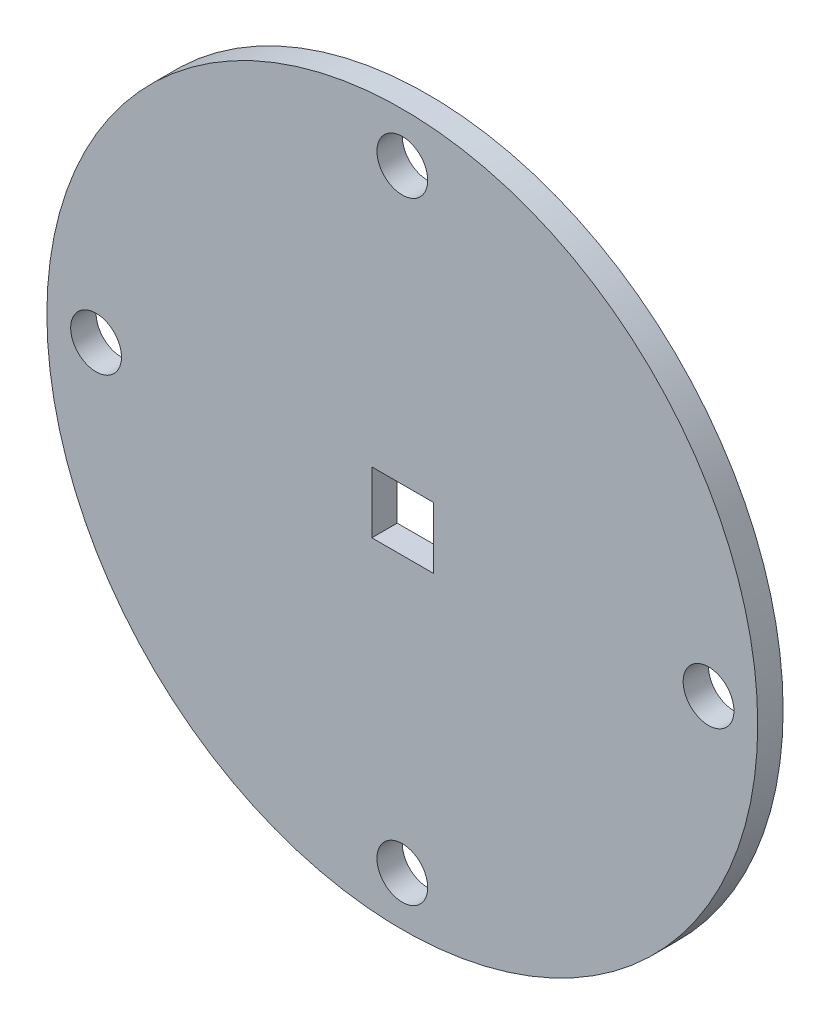
ISO-10303-21;
HEADER;
FILE_DESCRIPTION(('STEP AP214'),'2;1');
FILE_NAME('part.step','',(''),(''),'','','');
FILE_SCHEMA(('AUTOMOTIVE_DESIGN { 1 0 10303 214 1 1 1 1 }'));
ENDSEC;
DATA;
#1=APPLICATION_CONTEXT('core data for automotive mechanical design processes');
#2=APPLICATION_PROTOCOL_DEFINITION('international standard','automotive_design',2000,#1);
#3=PRODUCT_CONTEXT('',#1,'mechanical');
#4=PRODUCT('Part','Part','',(#3));
#5=PRODUCT_RELATED_PRODUCT_CATEGORY('part','',(#4));
#6=PRODUCT_DEFINITION_FORMATION('','',#4);
#7=PRODUCT_DEFINITION_CONTEXT('part definition',#1,'design');
#8=PRODUCT_DEFINITION('design','',#6,#7);
#9=PRODUCT_DEFINITION_SHAPE('','',#8);
#10=(LENGTH_UNIT() NAMED_UNIT(*) SI_UNIT(.MILLI.,.METRE.));
#11=(NAMED_UNIT(*) PLANE_ANGLE_UNIT() SI_UNIT($,.RADIAN.));
#12=(NAMED_UNIT(*) SI_UNIT($,.STERADIAN.) SOLID_ANGLE_UNIT());
#13=UNCERTAINTY_MEASURE_WITH_UNIT(LENGTH_MEASURE(1.E-05),#10,'distance_accuracy_value','');
#14=(GEOMETRIC_REPRESENTATION_CONTEXT(3) GLOBAL_UNCERTAINTY_ASSIGNED_CONTEXT((#13)) GLOBAL_UNIT_ASSIGNED_CONTEXT((#10,
#11,#12)) REPRESENTATION_CONTEXT('',''));
#15=CARTESIAN_POINT('',(0.,0.,0.));
#16=DIRECTION('',(0.,0.,1.));
#17=DIRECTION('',(1.,0.,0.));
#18=AXIS2_PLACEMENT_3D('',#15,#16,#17);
#19=CARTESIAN_POINT('',(0.,0.,5.));
#20=DIRECTION('',(0.,0.,1.));
#21=DIRECTION('',(1.,0.,0.));
#22=AXIS2_PLACEMENT_3D('',#19,#20,#21);
#23=PLANE('',#22);
#24=CARTESIAN_POINT('',(3.41345490180402E-12,-60.31,5.));
#25=DIRECTION('',(0.,0.,1.));
#26=DIRECTION('',(1.,0.,0.));
#27=AXIS2_PLACEMENT_3D('',#24,#25,#26);
#28=CIRCLE('',#27,5.00000000000367);
#29=CARTESIAN_POINT('',(5.00000000000708,-60.31,5.));
#30=VERTEX_POINT('',#29);
#31=EDGE_CURVE('E208',#30,#30,#28,.T.);
#32=ORIENTED_EDGE('',*,*,#31,.F.);
#33=EDGE_LOOP('',(#32));
#34=FACE_BOUND('',#33,.T.);
#35=CARTESIAN_POINT('',(0.,60.31,5.));
#36=DIRECTION('',(0.,0.,1.));
#37=DIRECTION('',(1.,0.,0.));
#38=AXIS2_PLACEMENT_3D('',#35,#36,#37);
#39=CIRCLE('',#38,5.);
#40=CARTESIAN_POINT('',(5.,60.31,5.));
#41=VERTEX_POINT('',#40);
#42=EDGE_CURVE('E104',#41,#41,#39,.T.);
#43=ORIENTED_EDGE('',*,*,#42,.F.);
#44=EDGE_LOOP('',(#43));
#45=FACE_BOUND('',#44,.T.);
#46=CARTESIAN_POINT('',(0.,0.,5.));
#47=DIRECTION('',(0.,0.,1.));
#48=DIRECTION('',(1.,0.,0.));
#49=AXIS2_PLACEMENT_3D('',#46,#47,#48);
#50=CIRCLE('',#49,70.);
#51=CARTESIAN_POINT('',(70.,0.,5.));
#52=VERTEX_POINT('',#51);
#53=EDGE_CURVE('E11',#52,#52,#50,.T.);
#54=ORIENTED_EDGE('',*,*,#53,.T.);
#55=EDGE_LOOP('',(#54));
#56=FACE_BOUND('',#55,.T.);
#57=DIRECTION('',(-1.,0.,0.));
#58=VECTOR('',#57,1.);
#59=CARTESIAN_POINT('',(-6.,5.95,5.));
#60=LINE('',#59,#58);
#61=CARTESIAN_POINT('',(6.1,5.95,5.));
#62=VERTEX_POINT('',#61);
#63=CARTESIAN_POINT('',(-6.,5.95,5.));
#64=VERTEX_POINT('',#63);
#65=EDGE_CURVE('E84',#62,#64,#60,.T.);
#66=ORIENTED_EDGE('',*,*,#65,.F.);
#67=DIRECTION('',(0.,1.,0.));
#68=VECTOR('',#67,1.);
#69=CARTESIAN_POINT('',(6.1,-6.15,5.));
#70=LINE('',#69,#68);
#71=CARTESIAN_POINT('',(6.1,-6.15,5.));
#72=VERTEX_POINT('',#71);
#73=EDGE_CURVE('E76',#72,#62,#70,.T.);
#74=ORIENTED_EDGE('',*,*,#73,.F.);
#75=DIRECTION('',(1.,0.,0.));
#76=VECTOR('',#75,1.);
#77=CARTESIAN_POINT('',(-6.,-6.15,5.));
#78=LINE('',#77,#76);
#79=CARTESIAN_POINT('',(-6.,-6.15,5.));
#80=VERTEX_POINT('',#79);
#81=EDGE_CURVE('E98',#80,#72,#78,.T.);
#82=ORIENTED_EDGE('',*,*,#81,.F.);
#83=DIRECTION('',(0.,-1.,0.));
#84=VECTOR('',#83,1.);
#85=CARTESIAN_POINT('',(-6.,-6.15,5.));
#86=LINE('',#85,#84);
#87=EDGE_CURVE('E96',#64,#80,#86,.T.);
#88=ORIENTED_EDGE('',*,*,#87,.F.);
#89=EDGE_LOOP('',(#66,#74,#82,#88));
#90=FACE_BOUND('',#89,.T.);
#91=CARTESIAN_POINT('',(60.3100000000017,1.70672745090201E-12,5.));
#92=DIRECTION('',(0.,0.,1.));
#93=DIRECTION('',(1.,0.,0.));
#94=AXIS2_PLACEMENT_3D('',#91,#92,#93);
#95=CIRCLE('',#94,5.00000000000134);
#96=CARTESIAN_POINT('',(65.3100000000031,1.70672745090201E-12,5.));
#97=VERTEX_POINT('',#96);
#98=EDGE_CURVE('E214',#97,#97,#95,.T.);
#99=ORIENTED_EDGE('',*,*,#98,.F.);
#100=EDGE_LOOP('',(#99));
#101=FACE_BOUND('',#100,.T.);
#102=CARTESIAN_POINT('',(-60.3099999999983,-1.71411329574767E-12,5.));
#103=DIRECTION('',(0.,0.,1.));
#104=DIRECTION('',(1.,0.,0.));
#105=AXIS2_PLACEMENT_3D('',#102,#103,#104);
#106=CIRCLE('',#105,5.00000000000274);
#107=CARTESIAN_POINT('',(-55.3099999999956,-1.71411329574767E-12,5.));
#108=VERTEX_POINT('',#107);
#109=EDGE_CURVE('E199',#108,#108,#106,.T.);
#110=ORIENTED_EDGE('',*,*,#109,.F.);
#111=EDGE_LOOP('',(#110));
#112=FACE_BOUND('',#111,.T.);
#113=ADVANCED_FACE('F35',(#34,#45,#56,#90,#101,#112),#23,.T.);
#114=CARTESIAN_POINT('',(0.,0.,0.));
#115=DIRECTION('',(0.,0.,1.));
#116=DIRECTION('',(1.,0.,0.));
#117=AXIS2_PLACEMENT_3D('',#114,#115,#116);
#118=PLANE('',#117);
#119=CARTESIAN_POINT('',(0.,0.,0.));
#120=DIRECTION('',(0.,0.,1.));
#121=DIRECTION('',(1.,0.,0.));
#122=AXIS2_PLACEMENT_3D('',#119,#120,#121);
#123=CIRCLE('',#122,70.);
#124=CARTESIAN_POINT('',(70.,0.,0.));
#125=VERTEX_POINT('',#124);
#126=EDGE_CURVE('E39',#125,#125,#123,.T.);
#127=ORIENTED_EDGE('',*,*,#126,.F.);
#128=EDGE_LOOP('',(#127));
#129=FACE_BOUND('',#128,.T.);
#130=DIRECTION('',(0.,1.,0.));
#131=VECTOR('',#130,1.);
#132=CARTESIAN_POINT('',(6.1,-6.15,0.));
#133=LINE('',#132,#131);
#134=CARTESIAN_POINT('',(6.1,-6.15,0.));
#135=VERTEX_POINT('',#134);
#136=CARTESIAN_POINT('',(6.1,5.95,0.));
#137=VERTEX_POINT('',#136);
#138=EDGE_CURVE('E58',#135,#137,#133,.T.);
#139=ORIENTED_EDGE('',*,*,#138,.T.);
#140=DIRECTION('',(-1.,0.,0.));
#141=VECTOR('',#140,1.);
#142=CARTESIAN_POINT('',(-6.,5.95,0.));
#143=LINE('',#142,#141);
#144=CARTESIAN_POINT('',(-6.,5.95,0.));
#145=VERTEX_POINT('',#144);
#146=EDGE_CURVE('E91',#137,#145,#143,.T.);
#147=ORIENTED_EDGE('',*,*,#146,.T.);
#148=DIRECTION('',(0.,-1.,0.));
#149=VECTOR('',#148,1.);
#150=CARTESIAN_POINT('',(-6.,-6.15,0.));
#151=LINE('',#150,#149);
#152=CARTESIAN_POINT('',(-6.,-6.15,0.));
#153=VERTEX_POINT('',#152);
#154=EDGE_CURVE('E106',#145,#153,#151,.T.);
#155=ORIENTED_EDGE('',*,*,#154,.T.);
#156=DIRECTION('',(1.,0.,0.));
#157=VECTOR('',#156,1.);
#158=CARTESIAN_POINT('',(-6.,-6.15,0.));
#159=LINE('',#158,#157);
#160=EDGE_CURVE('E85',#153,#135,#159,.T.);
#161=ORIENTED_EDGE('',*,*,#160,.T.);
#162=EDGE_LOOP('',(#139,#147,#155,#161));
#163=FACE_BOUND('',#162,.T.);
#164=CARTESIAN_POINT('',(0.,60.31,0.));
#165=DIRECTION('',(0.,0.,1.));
#166=DIRECTION('',(1.,0.,0.));
#167=AXIS2_PLACEMENT_3D('',#164,#165,#166);
#168=CIRCLE('',#167,5.);
#169=CARTESIAN_POINT('',(5.,60.31,0.));
#170=VERTEX_POINT('',#169);
#171=EDGE_CURVE('E217',#170,#170,#168,.T.);
#172=ORIENTED_EDGE('',*,*,#171,.T.);
#173=EDGE_LOOP('',(#172));
#174=FACE_BOUND('',#173,.T.);
#175=CARTESIAN_POINT('',(60.3100000000017,1.70672745090201E-12,0.));
#176=DIRECTION('',(0.,0.,1.));
#177=DIRECTION('',(1.,0.,0.));
#178=AXIS2_PLACEMENT_3D('',#175,#176,#177);
#179=CIRCLE('',#178,5.00000000000134);
#180=CARTESIAN_POINT('',(65.3100000000031,1.70672745090201E-12,0.));
#181=VERTEX_POINT('',#180);
#182=EDGE_CURVE('E211',#181,#181,#179,.T.);
#183=ORIENTED_EDGE('',*,*,#182,.T.);
#184=EDGE_LOOP('',(#183));
#185=FACE_BOUND('',#184,.T.);
#186=CARTESIAN_POINT('',(3.41345490180402E-12,-60.31,0.));
#187=DIRECTION('',(0.,0.,1.));
#188=DIRECTION('',(1.,0.,0.));
#189=AXIS2_PLACEMENT_3D('',#186,#187,#188);
#190=CIRCLE('',#189,5.00000000000367);
#191=CARTESIAN_POINT('',(5.00000000000708,-60.31,0.));
#192=VERTEX_POINT('',#191);
#193=EDGE_CURVE('E205',#192,#192,#190,.T.);
#194=ORIENTED_EDGE('',*,*,#193,.T.);
#195=EDGE_LOOP('',(#194));
#196=FACE_BOUND('',#195,.T.);
#197=CARTESIAN_POINT('',(-60.3099999999983,-1.71411329574767E-12,0.));
#198=DIRECTION('',(0.,0.,1.));
#199=DIRECTION('',(1.,0.,0.));
#200=AXIS2_PLACEMENT_3D('',#197,#198,#199);
#201=CIRCLE('',#200,5.00000000000274);
#202=CARTESIAN_POINT('',(-55.3099999999956,-1.71411329574767E-12,0.));
#203=VERTEX_POINT('',#202);
#204=EDGE_CURVE('E202',#203,#203,#201,.T.);
#205=ORIENTED_EDGE('',*,*,#204,.T.);
#206=EDGE_LOOP('',(#205));
#207=FACE_BOUND('',#206,.T.);
#208=ADVANCED_FACE('F117',(#129,#163,#174,#185,#196,#207),#118,.F.);
#209=CARTESIAN_POINT('',(0.,0.,5.));
#210=DIRECTION('',(0.,0.,-1.));
#211=DIRECTION('',(-1.,0.,0.));
#212=AXIS2_PLACEMENT_3D('',#209,#210,#211);
#213=CYLINDRICAL_SURFACE('',#212,70.);
#214=ORIENTED_EDGE('',*,*,#53,.F.);
#215=EDGE_LOOP('',(#214));
#216=FACE_BOUND('',#215,.T.);
#217=ORIENTED_EDGE('',*,*,#126,.T.);
#218=EDGE_LOOP('',(#217));
#219=FACE_BOUND('',#218,.T.);
#220=ADVANCED_FACE('F37',(#216,#219),#213,.T.);
#221=CARTESIAN_POINT('',(6.1,-6.15,5.));
#222=DIRECTION('',(-1.,0.,0.));
#223=DIRECTION('',(0.,0.,1.));
#224=AXIS2_PLACEMENT_3D('',#221,#222,#223);
#225=PLANE('',#224);
#226=ORIENTED_EDGE('',*,*,#138,.F.);
#227=DIRECTION('',(0.,0.,-1.));
#228=VECTOR('',#227,1.);
#229=CARTESIAN_POINT('',(6.1,-6.15,5.));
#230=LINE('',#229,#228);
#231=EDGE_CURVE('E80',#72,#135,#230,.T.);
#232=ORIENTED_EDGE('',*,*,#231,.F.);
#233=ORIENTED_EDGE('',*,*,#73,.T.);
#234=DIRECTION('',(0.,0.,-1.));
#235=VECTOR('',#234,1.);
#236=CARTESIAN_POINT('',(6.1,5.95,5.));
#237=LINE('',#236,#235);
#238=EDGE_CURVE('E79',#62,#137,#237,.T.);
#239=ORIENTED_EDGE('',*,*,#238,.T.);
#240=EDGE_LOOP('',(#226,#232,#233,#239));
#241=FACE_BOUND('',#240,.T.);
#242=ADVANCED_FACE('F78',(#241),#225,.T.);
#243=CARTESIAN_POINT('',(-6.,5.95,5.));
#244=DIRECTION('',(0.,-1.,0.));
#245=DIRECTION('',(0.,0.,-1.));
#246=AXIS2_PLACEMENT_3D('',#243,#244,#245);
#247=PLANE('',#246);
#248=ORIENTED_EDGE('',*,*,#146,.F.);
#249=ORIENTED_EDGE('',*,*,#238,.F.);
#250=ORIENTED_EDGE('',*,*,#65,.T.);
#251=DIRECTION('',(0.,0.,-1.));
#252=VECTOR('',#251,1.);
#253=CARTESIAN_POINT('',(-6.,5.95,5.));
#254=LINE('',#253,#252);
#255=EDGE_CURVE('E92',#64,#145,#254,.T.);
#256=ORIENTED_EDGE('',*,*,#255,.T.);
#257=EDGE_LOOP('',(#248,#249,#250,#256));
#258=FACE_BOUND('',#257,.T.);
#259=ADVANCED_FACE('F88',(#258),#247,.T.);
#260=CARTESIAN_POINT('',(-6.,-6.15,5.));
#261=DIRECTION('',(1.,0.,0.));
#262=DIRECTION('',(0.,0.,-1.));
#263=AXIS2_PLACEMENT_3D('',#260,#261,#262);
#264=PLANE('',#263);
#265=ORIENTED_EDGE('',*,*,#154,.F.);
#266=ORIENTED_EDGE('',*,*,#255,.F.);
#267=ORIENTED_EDGE('',*,*,#87,.T.);
#268=DIRECTION('',(0.,0.,-1.));
#269=VECTOR('',#268,1.);
#270=CARTESIAN_POINT('',(-6.,-6.15,5.));
#271=LINE('',#270,#269);
#272=EDGE_CURVE('E50',#80,#153,#271,.T.);
#273=ORIENTED_EDGE('',*,*,#272,.T.);
#274=EDGE_LOOP('',(#265,#266,#267,#273));
#275=FACE_BOUND('',#274,.T.);
#276=ADVANCED_FACE('F115',(#275),#264,.T.);
#277=CARTESIAN_POINT('',(-6.,-6.15,5.));
#278=DIRECTION('',(0.,1.,0.));
#279=DIRECTION('',(0.,0.,1.));
#280=AXIS2_PLACEMENT_3D('',#277,#278,#279);
#281=PLANE('',#280);
#282=ORIENTED_EDGE('',*,*,#160,.F.);
#283=ORIENTED_EDGE('',*,*,#272,.F.);
#284=ORIENTED_EDGE('',*,*,#81,.T.);
#285=ORIENTED_EDGE('',*,*,#231,.T.);
#286=EDGE_LOOP('',(#282,#283,#284,#285));
#287=FACE_BOUND('',#286,.T.);
#288=ADVANCED_FACE('F119',(#287),#281,.T.);
#289=CARTESIAN_POINT('',(0.,60.31,5.));
#290=DIRECTION('',(0.,0.,-1.));
#291=DIRECTION('',(-1.,0.,0.));
#292=AXIS2_PLACEMENT_3D('',#289,#290,#291);
#293=CYLINDRICAL_SURFACE('',#292,5.);
#294=ORIENTED_EDGE('',*,*,#42,.T.);
#295=EDGE_LOOP('',(#294));
#296=FACE_BOUND('',#295,.T.);
#297=ORIENTED_EDGE('',*,*,#171,.F.);
#298=EDGE_LOOP('',(#297));
#299=FACE_BOUND('',#298,.T.);
#300=ADVANCED_FACE('F121',(#296,#299),#293,.F.);
#301=CARTESIAN_POINT('',(60.3100000000017,1.70672745090201E-12,5.));
#302=DIRECTION('',(0.,0.,-1.));
#303=DIRECTION('',(-1.,0.,0.));
#304=AXIS2_PLACEMENT_3D('',#301,#302,#303);
#305=CYLINDRICAL_SURFACE('',#304,5.00000000000134);
#306=ORIENTED_EDGE('',*,*,#98,.T.);
#307=EDGE_LOOP('',(#306));
#308=FACE_BOUND('',#307,.T.);
#309=ORIENTED_EDGE('',*,*,#182,.F.);
#310=EDGE_LOOP('',(#309));
#311=FACE_BOUND('',#310,.T.);
#312=ADVANCED_FACE('F127',(#308,#311),#305,.F.);
#313=CARTESIAN_POINT('',(3.41345490180402E-12,-60.31,5.));
#314=DIRECTION('',(0.,0.,-1.));
#315=DIRECTION('',(-1.,0.,0.));
#316=AXIS2_PLACEMENT_3D('',#313,#314,#315);
#317=CYLINDRICAL_SURFACE('',#316,5.00000000000367);
#318=ORIENTED_EDGE('',*,*,#31,.T.);
#319=EDGE_LOOP('',(#318));
#320=FACE_BOUND('',#319,.T.);
#321=ORIENTED_EDGE('',*,*,#193,.F.);
#322=EDGE_LOOP('',(#321));
#323=FACE_BOUND('',#322,.T.);
#324=ADVANCED_FACE('F172',(#320,#323),#317,.F.);
#325=CARTESIAN_POINT('',(-60.3099999999983,-1.71411329574767E-12,5.));
#326=DIRECTION('',(0.,0.,-1.));
#327=DIRECTION('',(-1.,0.,0.));
#328=AXIS2_PLACEMENT_3D('',#325,#326,#327);
#329=CYLINDRICAL_SURFACE('',#328,5.00000000000274);
#330=ORIENTED_EDGE('',*,*,#109,.T.);
#331=EDGE_LOOP('',(#330));
#332=FACE_BOUND('',#331,.T.);
#333=ORIENTED_EDGE('',*,*,#204,.F.);
#334=EDGE_LOOP('',(#333));
#335=FACE_BOUND('',#334,.T.);
#336=ADVANCED_FACE('F182',(#332,#335),#329,.F.);
#337=CLOSED_SHELL('',(#113,#208,#220,#242,#259,#276,#288,#300,#312,#324,#336));
#338=MANIFOLD_SOLID_BREP('B2',#337);
#339=ADVANCED_BREP_SHAPE_REPRESENTATION('',(#18,#338),#14);
#340=SHAPE_DEFINITION_REPRESENTATION(#9,#339);
ENDSEC;
END-ISO-10303-21;
